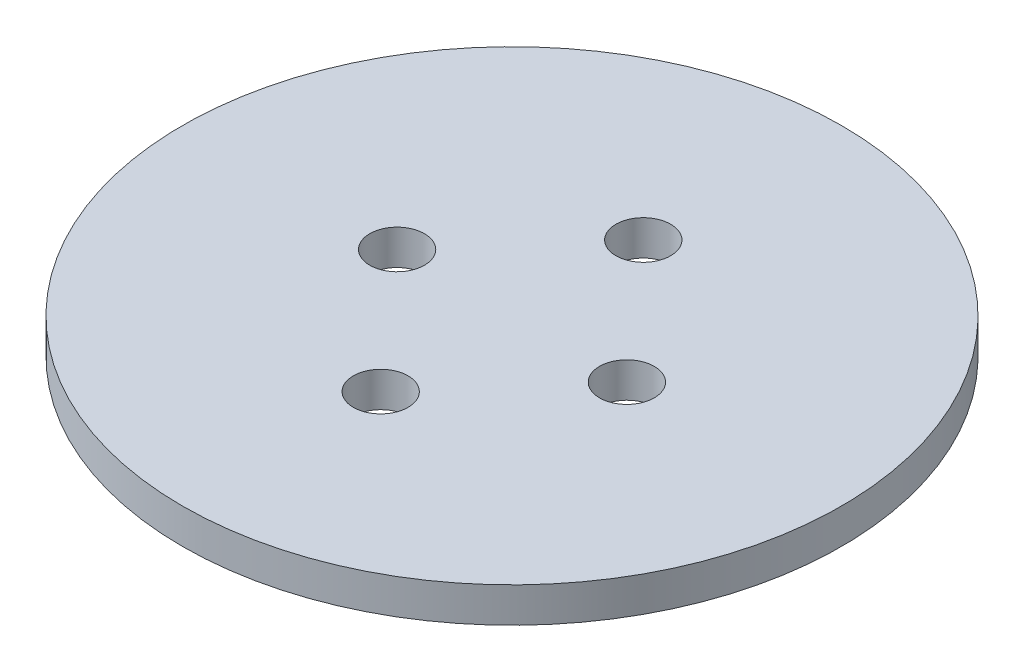
ISO-10303-21;
HEADER;
FILE_DESCRIPTION(('STEP AP214'),'2;1');
FILE_NAME('part.step','',(''),(''),'','','');
FILE_SCHEMA(('AUTOMOTIVE_DESIGN { 1 0 10303 214 1 1 1 1 }'));
ENDSEC;
DATA;
#1=APPLICATION_CONTEXT('core data for automotive mechanical design processes');
#2=APPLICATION_PROTOCOL_DEFINITION('international standard','automotive_design',2000,#1);
#3=PRODUCT_CONTEXT('',#1,'mechanical');
#4=PRODUCT('Part','Part','',(#3));
#5=PRODUCT_RELATED_PRODUCT_CATEGORY('part','',(#4));
#6=PRODUCT_DEFINITION_FORMATION('','',#4);
#7=PRODUCT_DEFINITION_CONTEXT('part definition',#1,'design');
#8=PRODUCT_DEFINITION('design','',#6,#7);
#9=PRODUCT_DEFINITION_SHAPE('','',#8);
#10=(LENGTH_UNIT() NAMED_UNIT(*) SI_UNIT(.MILLI.,.METRE.));
#11=(NAMED_UNIT(*) PLANE_ANGLE_UNIT() SI_UNIT($,.RADIAN.));
#12=(NAMED_UNIT(*) SI_UNIT($,.STERADIAN.) SOLID_ANGLE_UNIT());
#13=UNCERTAINTY_MEASURE_WITH_UNIT(LENGTH_MEASURE(1.E-05),#10,'distance_accuracy_value','');
#14=(GEOMETRIC_REPRESENTATION_CONTEXT(3) GLOBAL_UNCERTAINTY_ASSIGNED_CONTEXT((#13)) GLOBAL_UNIT_ASSIGNED_CONTEXT((#10,
#11,#12)) REPRESENTATION_CONTEXT('',''));
#15=CARTESIAN_POINT('',(0.,0.,0.));
#16=DIRECTION('',(0.,0.,1.));
#17=DIRECTION('',(1.,0.,0.));
#18=AXIS2_PLACEMENT_3D('',#15,#16,#17);
#19=CARTESIAN_POINT('',(0.,5.08,0.));
#20=DIRECTION('',(0.,-1.,0.));
#21=DIRECTION('',(0.,0.,-1.));
#22=AXIS2_PLACEMENT_3D('',#19,#20,#21);
#23=CYLINDRICAL_SURFACE('',#22,47.8155);
#24=CARTESIAN_POINT('',(0.,5.08,0.));
#25=DIRECTION('',(0.,1.,0.));
#26=DIRECTION('',(0.,0.,1.));
#27=AXIS2_PLACEMENT_3D('',#24,#25,#26);
#28=CIRCLE('',#27,47.8155);
#29=CARTESIAN_POINT('',(0.,5.08,47.8155));
#30=VERTEX_POINT('',#29);
#31=EDGE_CURVE('E10',#30,#30,#28,.T.);
#32=ORIENTED_EDGE('',*,*,#31,.F.);
#33=EDGE_LOOP('',(#32));
#34=FACE_BOUND('',#33,.T.);
#35=CARTESIAN_POINT('',(0.,0.,0.));
#36=DIRECTION('',(0.,1.,0.));
#37=DIRECTION('',(0.,0.,1.));
#38=AXIS2_PLACEMENT_3D('',#35,#36,#37);
#39=CIRCLE('',#38,47.8155);
#40=CARTESIAN_POINT('',(0.,0.,47.8155));
#41=VERTEX_POINT('',#40);
#42=EDGE_CURVE('E42',#41,#41,#39,.T.);
#43=ORIENTED_EDGE('',*,*,#42,.T.);
#44=EDGE_LOOP('',(#43));
#45=FACE_BOUND('',#44,.T.);
#46=ADVANCED_FACE('F39',(#34,#45),#23,.T.);
#47=CARTESIAN_POINT('',(0.,5.08,0.));
#48=DIRECTION('',(0.,1.,0.));
#49=DIRECTION('',(0.,0.,1.));
#50=AXIS2_PLACEMENT_3D('',#47,#48,#49);
#51=PLANE('',#50);
#52=CARTESIAN_POINT('',(0.,5.08,19.05));
#53=DIRECTION('',(0.,1.,0.));
#54=DIRECTION('',(0.,0.,1.));
#55=AXIS2_PLACEMENT_3D('',#52,#53,#54);
#56=CIRCLE('',#55,3.96875);
#57=CARTESIAN_POINT('',(0.,5.08,23.01875));
#58=VERTEX_POINT('',#57);
#59=EDGE_CURVE('E71',#58,#58,#56,.T.);
#60=ORIENTED_EDGE('',*,*,#59,.F.);
#61=EDGE_LOOP('',(#60));
#62=FACE_BOUND('',#61,.T.);
#63=CARTESIAN_POINT('',(0.,5.08,-19.05));
#64=DIRECTION('',(0.,1.,0.));
#65=DIRECTION('',(0.,0.,1.));
#66=AXIS2_PLACEMENT_3D('',#63,#64,#65);
#67=CIRCLE('',#66,3.96875);
#68=CARTESIAN_POINT('',(0.,5.08,-15.08125));
#69=VERTEX_POINT('',#68);
#70=EDGE_CURVE('E65',#69,#69,#67,.T.);
#71=ORIENTED_EDGE('',*,*,#70,.F.);
#72=EDGE_LOOP('',(#71));
#73=FACE_BOUND('',#72,.T.);
#74=CARTESIAN_POINT('',(-16.66875,5.08,0.));
#75=DIRECTION('',(0.,1.,0.));
#76=DIRECTION('',(0.,0.,1.));
#77=AXIS2_PLACEMENT_3D('',#74,#75,#76);
#78=CIRCLE('',#77,3.96875);
#79=CARTESIAN_POINT('',(-16.66875,5.08,3.96875));
#80=VERTEX_POINT('',#79);
#81=EDGE_CURVE('E59',#80,#80,#78,.T.);
#82=ORIENTED_EDGE('',*,*,#81,.F.);
#83=EDGE_LOOP('',(#82));
#84=FACE_BOUND('',#83,.T.);
#85=CARTESIAN_POINT('',(16.66875,5.08,0.));
#86=DIRECTION('',(0.,1.,0.));
#87=DIRECTION('',(0.,0.,1.));
#88=AXIS2_PLACEMENT_3D('',#85,#86,#87);
#89=CIRCLE('',#88,3.96875);
#90=CARTESIAN_POINT('',(16.66875,5.08,3.96875));
#91=VERTEX_POINT('',#90);
#92=EDGE_CURVE('E53',#91,#91,#89,.T.);
#93=ORIENTED_EDGE('',*,*,#92,.F.);
#94=EDGE_LOOP('',(#93));
#95=FACE_BOUND('',#94,.T.);
#96=ORIENTED_EDGE('',*,*,#31,.T.);
#97=EDGE_LOOP('',(#96));
#98=FACE_BOUND('',#97,.T.);
#99=ADVANCED_FACE('F77',(#62,#73,#84,#95,#98),#51,.T.);
#100=CARTESIAN_POINT('',(0.,0.,0.));
#101=DIRECTION('',(0.,1.,0.));
#102=DIRECTION('',(0.,0.,1.));
#103=AXIS2_PLACEMENT_3D('',#100,#101,#102);
#104=PLANE('',#103);
#105=CARTESIAN_POINT('',(0.,0.,19.05));
#106=DIRECTION('',(0.,1.,0.));
#107=DIRECTION('',(0.,0.,1.));
#108=AXIS2_PLACEMENT_3D('',#105,#106,#107);
#109=CIRCLE('',#108,3.96875);
#110=CARTESIAN_POINT('',(0.,0.,23.01875));
#111=VERTEX_POINT('',#110);
#112=EDGE_CURVE('E68',#111,#111,#109,.T.);
#113=ORIENTED_EDGE('',*,*,#112,.T.);
#114=EDGE_LOOP('',(#113));
#115=FACE_BOUND('',#114,.T.);
#116=CARTESIAN_POINT('',(0.,0.,-19.05));
#117=DIRECTION('',(0.,1.,0.));
#118=DIRECTION('',(0.,0.,1.));
#119=AXIS2_PLACEMENT_3D('',#116,#117,#118);
#120=CIRCLE('',#119,3.96875);
#121=CARTESIAN_POINT('',(0.,0.,-15.08125));
#122=VERTEX_POINT('',#121);
#123=EDGE_CURVE('E62',#122,#122,#120,.T.);
#124=ORIENTED_EDGE('',*,*,#123,.T.);
#125=EDGE_LOOP('',(#124));
#126=FACE_BOUND('',#125,.T.);
#127=CARTESIAN_POINT('',(-16.66875,0.,0.));
#128=DIRECTION('',(0.,1.,0.));
#129=DIRECTION('',(0.,0.,1.));
#130=AXIS2_PLACEMENT_3D('',#127,#128,#129);
#131=CIRCLE('',#130,3.96875);
#132=CARTESIAN_POINT('',(-16.66875,0.,3.96875));
#133=VERTEX_POINT('',#132);
#134=EDGE_CURVE('E56',#133,#133,#131,.T.);
#135=ORIENTED_EDGE('',*,*,#134,.T.);
#136=EDGE_LOOP('',(#135));
#137=FACE_BOUND('',#136,.T.);
#138=CARTESIAN_POINT('',(16.66875,0.,0.));
#139=DIRECTION('',(0.,1.,0.));
#140=DIRECTION('',(0.,0.,1.));
#141=AXIS2_PLACEMENT_3D('',#138,#139,#140);
#142=CIRCLE('',#141,3.96875);
#143=CARTESIAN_POINT('',(16.66875,0.,3.96875));
#144=VERTEX_POINT('',#143);
#145=EDGE_CURVE('E49',#144,#144,#142,.T.);
#146=ORIENTED_EDGE('',*,*,#145,.T.);
#147=EDGE_LOOP('',(#146));
#148=FACE_BOUND('',#147,.T.);
#149=ORIENTED_EDGE('',*,*,#42,.F.);
#150=EDGE_LOOP('',(#149));
#151=FACE_BOUND('',#150,.T.);
#152=ADVANCED_FACE('F80',(#115,#126,#137,#148,#151),#104,.F.);
#153=CARTESIAN_POINT('',(16.66875,5.08,0.));
#154=DIRECTION('',(0.,1.,0.));
#155=DIRECTION('',(0.,0.,1.));
#156=AXIS2_PLACEMENT_3D('',#153,#154,#155);
#157=CYLINDRICAL_SURFACE('',#156,3.96875);
#158=ORIENTED_EDGE('',*,*,#145,.F.);
#159=EDGE_LOOP('',(#158));
#160=FACE_BOUND('',#159,.T.);
#161=ORIENTED_EDGE('',*,*,#92,.T.);
#162=EDGE_LOOP('',(#161));
#163=FACE_BOUND('',#162,.T.);
#164=ADVANCED_FACE('F88',(#160,#163),#157,.F.);
#165=CARTESIAN_POINT('',(-16.66875,5.08,0.));
#166=DIRECTION('',(0.,1.,0.));
#167=DIRECTION('',(0.,0.,1.));
#168=AXIS2_PLACEMENT_3D('',#165,#166,#167);
#169=CYLINDRICAL_SURFACE('',#168,3.96875);
#170=ORIENTED_EDGE('',*,*,#134,.F.);
#171=EDGE_LOOP('',(#170));
#172=FACE_BOUND('',#171,.T.);
#173=ORIENTED_EDGE('',*,*,#81,.T.);
#174=EDGE_LOOP('',(#173));
#175=FACE_BOUND('',#174,.T.);
#176=ADVANCED_FACE('F90',(#172,#175),#169,.F.);
#177=CARTESIAN_POINT('',(0.,5.08,-19.05));
#178=DIRECTION('',(0.,1.,0.));
#179=DIRECTION('',(0.,0.,1.));
#180=AXIS2_PLACEMENT_3D('',#177,#178,#179);
#181=CYLINDRICAL_SURFACE('',#180,3.96875);
#182=ORIENTED_EDGE('',*,*,#123,.F.);
#183=EDGE_LOOP('',(#182));
#184=FACE_BOUND('',#183,.T.);
#185=ORIENTED_EDGE('',*,*,#70,.T.);
#186=EDGE_LOOP('',(#185));
#187=FACE_BOUND('',#186,.T.);
#188=ADVANCED_FACE('F97',(#184,#187),#181,.F.);
#189=CARTESIAN_POINT('',(0.,5.08,19.05));
#190=DIRECTION('',(0.,1.,0.));
#191=DIRECTION('',(0.,0.,1.));
#192=AXIS2_PLACEMENT_3D('',#189,#190,#191);
#193=CYLINDRICAL_SURFACE('',#192,3.96875);
#194=ORIENTED_EDGE('',*,*,#112,.F.);
#195=EDGE_LOOP('',(#194));
#196=FACE_BOUND('',#195,.T.);
#197=ORIENTED_EDGE('',*,*,#59,.T.);
#198=EDGE_LOOP('',(#197));
#199=FACE_BOUND('',#198,.T.);
#200=ADVANCED_FACE('F75',(#196,#199),#193,.F.);
#201=CLOSED_SHELL('',(#46,#99,#152,#164,#176,#188,#200));
#202=MANIFOLD_SOLID_BREP('B2',#201);
#203=ADVANCED_BREP_SHAPE_REPRESENTATION('',(#18,#202),#14);
#204=SHAPE_DEFINITION_REPRESENTATION(#9,#203);
ENDSEC;
END-ISO-10303-21;
